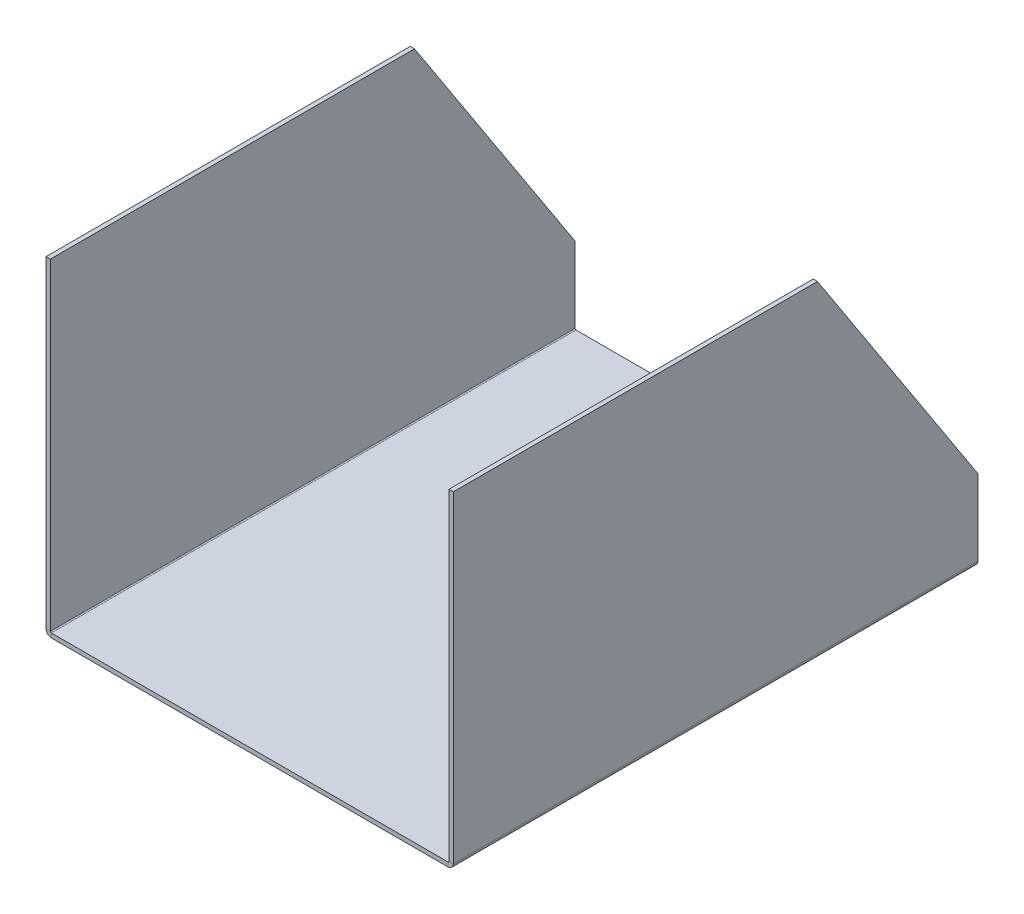
ISO-10303-21;
HEADER;
FILE_DESCRIPTION(('STEP AP214'),'2;1');
FILE_NAME('part.step','',(''),(''),'','','');
FILE_SCHEMA(('AUTOMOTIVE_DESIGN { 1 0 10303 214 1 1 1 1 }'));
ENDSEC;
DATA;
#1=APPLICATION_CONTEXT('core data for automotive mechanical design processes');
#2=APPLICATION_PROTOCOL_DEFINITION('international standard','automotive_design',2000,#1);
#3=PRODUCT_CONTEXT('',#1,'mechanical');
#4=PRODUCT('Part','Part','',(#3));
#5=PRODUCT_RELATED_PRODUCT_CATEGORY('part','',(#4));
#6=PRODUCT_DEFINITION_FORMATION('','',#4);
#7=PRODUCT_DEFINITION_CONTEXT('part definition',#1,'design');
#8=PRODUCT_DEFINITION('design','',#6,#7);
#9=PRODUCT_DEFINITION_SHAPE('','',#8);
#10=(LENGTH_UNIT() NAMED_UNIT(*) SI_UNIT(.MILLI.,.METRE.));
#11=(NAMED_UNIT(*) PLANE_ANGLE_UNIT() SI_UNIT($,.RADIAN.));
#12=(NAMED_UNIT(*) SI_UNIT($,.STERADIAN.) SOLID_ANGLE_UNIT());
#13=UNCERTAINTY_MEASURE_WITH_UNIT(LENGTH_MEASURE(1.E-05),#10,'distance_accuracy_value','');
#14=(GEOMETRIC_REPRESENTATION_CONTEXT(3) GLOBAL_UNCERTAINTY_ASSIGNED_CONTEXT((#13)) GLOBAL_UNIT_ASSIGNED_CONTEXT((#10,
#11,#12)) REPRESENTATION_CONTEXT('',''));
#15=CARTESIAN_POINT('',(0.,0.,0.));
#16=DIRECTION('',(0.,0.,1.));
#17=DIRECTION('',(1.,0.,0.));
#18=AXIS2_PLACEMENT_3D('',#15,#16,#17);
#19=CARTESIAN_POINT('',(-184.,-4.,0.));
#20=DIRECTION('',(0.,0.,-1.));
#21=DIRECTION('',(-1.,0.,0.));
#22=AXIS2_PLACEMENT_3D('',#19,#20,#21);
#23=PLANE('',#22);
#24=DIRECTION('',(0.,1.,0.));
#25=VECTOR('',#24,1.);
#26=CARTESIAN_POINT('',(-189.,0.,0.));
#27=LINE('',#26,#25);
#28=CARTESIAN_POINT('',(-189.,70.9999999999999,0.));
#29=VERTEX_POINT('',#28);
#30=CARTESIAN_POINT('',(-189.,1.,0.));
#31=VERTEX_POINT('',#30);
#32=EDGE_CURVE('E151',#29,#31,#27,.F.);
#33=ORIENTED_EDGE('',*,*,#32,.F.);
#34=DIRECTION('',(-1.,0.,0.));
#35=VECTOR('',#34,1.);
#36=CARTESIAN_POINT('',(-189.,70.9999999999998,0.));
#37=LINE('',#36,#35);
#38=CARTESIAN_POINT('',(-185.,70.9999999999998,0.));
#39=VERTEX_POINT('',#38);
#40=EDGE_CURVE('E54',#29,#39,#37,.F.);
#41=ORIENTED_EDGE('',*,*,#40,.T.);
#42=DIRECTION('',(0.,-1.,0.));
#43=VECTOR('',#42,1.);
#44=CARTESIAN_POINT('',(-185.,0.,0.));
#45=LINE('',#44,#43);
#46=CARTESIAN_POINT('',(-185.,1.,0.));
#47=VERTEX_POINT('',#46);
#48=EDGE_CURVE('E149',#39,#47,#45,.T.);
#49=ORIENTED_EDGE('',*,*,#48,.T.);
#50=DIRECTION('',(-1.,0.,0.));
#51=VECTOR('',#50,1.);
#52=CARTESIAN_POINT('',(-185.,1.,0.));
#53=LINE('',#52,#51);
#54=EDGE_CURVE('E221',#47,#31,#53,.T.);
#55=ORIENTED_EDGE('',*,*,#54,.T.);
#56=EDGE_LOOP('',(#33,#41,#49,#55));
#57=FACE_BOUND('',#56,.T.);
#58=ADVANCED_FACE('F39',(#57),#23,.T.);
#59=CARTESIAN_POINT('',(-185.,0.,487.));
#60=DIRECTION('',(1.,0.,0.));
#61=DIRECTION('',(0.,0.,-1.));
#62=AXIS2_PLACEMENT_3D('',#59,#60,#61);
#63=PLANE('',#62);
#64=ORIENTED_EDGE('',*,*,#48,.F.);
#65=DIRECTION('',(0.,0.838192650545649,0.545374257341929));
#66=VECTOR('',#65,1.);
#67=CARTESIAN_POINT('',(-185.,300.,149.));
#68=LINE('',#67,#66);
#69=CARTESIAN_POINT('',(-185.,300.,149.));
#70=VERTEX_POINT('',#69);
#71=EDGE_CURVE('E137',#39,#70,#68,.T.);
#72=ORIENTED_EDGE('',*,*,#71,.T.);
#73=DIRECTION('',(0.,0.,-1.));
#74=VECTOR('',#73,1.);
#75=CARTESIAN_POINT('',(-185.,300.,487.));
#76=LINE('',#75,#74);
#77=CARTESIAN_POINT('',(-185.,300.,487.));
#78=VERTEX_POINT('',#77);
#79=EDGE_CURVE('E193',#78,#70,#76,.T.);
#80=ORIENTED_EDGE('',*,*,#79,.F.);
#81=DIRECTION('',(0.,-1.,0.));
#82=VECTOR('',#81,1.);
#83=CARTESIAN_POINT('',(-185.,0.,487.));
#84=LINE('',#83,#82);
#85=CARTESIAN_POINT('',(-185.,1.,487.));
#86=VERTEX_POINT('',#85);
#87=EDGE_CURVE('E227',#78,#86,#84,.T.);
#88=ORIENTED_EDGE('',*,*,#87,.T.);
#89=DIRECTION('',(0.,0.,-1.));
#90=VECTOR('',#89,1.);
#91=CARTESIAN_POINT('',(-185.,1.,487.));
#92=LINE('',#91,#90);
#93=EDGE_CURVE('E157',#86,#47,#92,.T.);
#94=ORIENTED_EDGE('',*,*,#93,.T.);
#95=EDGE_LOOP('',(#64,#72,#80,#88,#94));
#96=FACE_BOUND('',#95,.T.);
#97=ADVANCED_FACE('F154',(#96),#63,.T.);
#98=CARTESIAN_POINT('',(-189.,300.,487.));
#99=DIRECTION('',(0.,1.,0.));
#100=DIRECTION('',(0.,0.,1.));
#101=AXIS2_PLACEMENT_3D('',#98,#99,#100);
#102=PLANE('',#101);
#103=ORIENTED_EDGE('',*,*,#79,.T.);
#104=DIRECTION('',(-1.,0.,0.));
#105=VECTOR('',#104,1.);
#106=CARTESIAN_POINT('',(-189.,300.,149.));
#107=LINE('',#106,#105);
#108=CARTESIAN_POINT('',(-189.,300.,149.));
#109=VERTEX_POINT('',#108);
#110=EDGE_CURVE('E140',#109,#70,#107,.F.);
#111=ORIENTED_EDGE('',*,*,#110,.F.);
#112=DIRECTION('',(0.,0.,-1.));
#113=VECTOR('',#112,1.);
#114=CARTESIAN_POINT('',(-189.,300.,487.));
#115=LINE('',#114,#113);
#116=CARTESIAN_POINT('',(-189.,300.,487.));
#117=VERTEX_POINT('',#116);
#118=EDGE_CURVE('E190',#117,#109,#115,.T.);
#119=ORIENTED_EDGE('',*,*,#118,.F.);
#120=DIRECTION('',(1.,0.,0.));
#121=VECTOR('',#120,1.);
#122=CARTESIAN_POINT('',(-189.,300.,487.));
#123=LINE('',#122,#121);
#124=EDGE_CURVE('E242',#117,#78,#123,.T.);
#125=ORIENTED_EDGE('',*,*,#124,.T.);
#126=EDGE_LOOP('',(#103,#111,#119,#125));
#127=FACE_BOUND('',#126,.T.);
#128=ADVANCED_FACE('F344',(#127),#102,.T.);
#129=CARTESIAN_POINT('',(-189.,0.,487.));
#130=DIRECTION('',(1.,0.,0.));
#131=DIRECTION('',(0.,0.,-1.));
#132=AXIS2_PLACEMENT_3D('',#129,#130,#131);
#133=PLANE('',#132);
#134=DIRECTION('',(0.,0.838192650545649,0.545374257341929));
#135=VECTOR('',#134,1.);
#136=CARTESIAN_POINT('',(-189.,300.,149.));
#137=LINE('',#136,#135);
#138=EDGE_CURVE('E144',#29,#109,#137,.T.);
#139=ORIENTED_EDGE('',*,*,#138,.F.);
#140=ORIENTED_EDGE('',*,*,#32,.T.);
#141=DIRECTION('',(0.,0.,-1.));
#142=VECTOR('',#141,1.);
#143=CARTESIAN_POINT('',(-189.,1.,487.));
#144=LINE('',#143,#142);
#145=CARTESIAN_POINT('',(-189.,1.,487.));
#146=VERTEX_POINT('',#145);
#147=EDGE_CURVE('E187',#146,#31,#144,.T.);
#148=ORIENTED_EDGE('',*,*,#147,.F.);
#149=DIRECTION('',(0.,1.,0.));
#150=VECTOR('',#149,1.);
#151=CARTESIAN_POINT('',(-189.,0.,487.));
#152=LINE('',#151,#150);
#153=EDGE_CURVE('E230',#117,#146,#152,.F.);
#154=ORIENTED_EDGE('',*,*,#153,.F.);
#155=ORIENTED_EDGE('',*,*,#118,.T.);
#156=EDGE_LOOP('',(#139,#140,#148,#154,#155));
#157=FACE_BOUND('',#156,.T.);
#158=ADVANCED_FACE('F283',(#157),#133,.F.);
#159=CARTESIAN_POINT('',(189.,0.,487.));
#160=DIRECTION('',(-1.,0.,0.));
#161=DIRECTION('',(0.,0.,1.));
#162=AXIS2_PLACEMENT_3D('',#159,#160,#161);
#163=PLANE('',#162);
#164=DIRECTION('',(0.,-0.838192650545649,-0.545374257341929));
#165=VECTOR('',#164,1.);
#166=CARTESIAN_POINT('',(189.,71.0000000000001,0.));
#167=LINE('',#166,#165);
#168=CARTESIAN_POINT('',(189.,300.,149.));
#169=VERTEX_POINT('',#168);
#170=CARTESIAN_POINT('',(189.,71.0000000000001,0.));
#171=VERTEX_POINT('',#170);
#172=EDGE_CURVE('E62',#169,#171,#167,.T.);
#173=ORIENTED_EDGE('',*,*,#172,.F.);
#174=DIRECTION('',(0.,0.,-1.));
#175=VECTOR('',#174,1.);
#176=CARTESIAN_POINT('',(189.,300.,487.));
#177=LINE('',#176,#175);
#178=CARTESIAN_POINT('',(189.,300.,487.));
#179=VERTEX_POINT('',#178);
#180=EDGE_CURVE('E208',#179,#169,#177,.T.);
#181=ORIENTED_EDGE('',*,*,#180,.F.);
#182=DIRECTION('',(0.,1.,0.));
#183=VECTOR('',#182,1.);
#184=CARTESIAN_POINT('',(189.,0.,487.));
#185=LINE('',#184,#183);
#186=CARTESIAN_POINT('',(189.,1.00000000000007,487.));
#187=VERTEX_POINT('',#186);
#188=EDGE_CURVE('E176',#187,#179,#185,.T.);
#189=ORIENTED_EDGE('',*,*,#188,.F.);
#190=DIRECTION('',(0.,0.,-1.));
#191=VECTOR('',#190,1.);
#192=CARTESIAN_POINT('',(189.,1.00000000000007,487.));
#193=LINE('',#192,#191);
#194=CARTESIAN_POINT('',(189.,1.00000000000007,0.));
#195=VERTEX_POINT('',#194);
#196=EDGE_CURVE('E177',#187,#195,#193,.T.);
#197=ORIENTED_EDGE('',*,*,#196,.T.);
#198=DIRECTION('',(0.,1.,0.));
#199=VECTOR('',#198,1.);
#200=CARTESIAN_POINT('',(189.,0.,0.));
#201=LINE('',#200,#199);
#202=EDGE_CURVE('E255',#195,#171,#201,.T.);
#203=ORIENTED_EDGE('',*,*,#202,.T.);
#204=EDGE_LOOP('',(#173,#181,#189,#197,#203));
#205=FACE_BOUND('',#204,.T.);
#206=ADVANCED_FACE('F336',(#205),#163,.F.);
#207=CARTESIAN_POINT('',(185.,300.,487.));
#208=DIRECTION('',(0.,1.,0.));
#209=DIRECTION('',(0.,0.,1.));
#210=AXIS2_PLACEMENT_3D('',#207,#208,#209);
#211=PLANE('',#210);
#212=ORIENTED_EDGE('',*,*,#180,.T.);
#213=DIRECTION('',(1.,0.,0.));
#214=VECTOR('',#213,1.);
#215=CARTESIAN_POINT('',(189.,300.,149.));
#216=LINE('',#215,#214);
#217=CARTESIAN_POINT('',(185.,300.,149.));
#218=VERTEX_POINT('',#217);
#219=EDGE_CURVE('E259',#169,#218,#216,.F.);
#220=ORIENTED_EDGE('',*,*,#219,.T.);
#221=DIRECTION('',(0.,0.,-1.));
#222=VECTOR('',#221,1.);
#223=CARTESIAN_POINT('',(185.,300.,487.));
#224=LINE('',#223,#222);
#225=CARTESIAN_POINT('',(185.,300.,487.));
#226=VERTEX_POINT('',#225);
#227=EDGE_CURVE('E205',#226,#218,#224,.T.);
#228=ORIENTED_EDGE('',*,*,#227,.F.);
#229=DIRECTION('',(1.,0.,0.));
#230=VECTOR('',#229,1.);
#231=CARTESIAN_POINT('',(185.,300.,487.));
#232=LINE('',#231,#230);
#233=EDGE_CURVE('E296',#226,#179,#232,.T.);
#234=ORIENTED_EDGE('',*,*,#233,.T.);
#235=EDGE_LOOP('',(#212,#220,#228,#234));
#236=FACE_BOUND('',#235,.T.);
#237=ADVANCED_FACE('F326',(#236),#211,.T.);
#238=CARTESIAN_POINT('',(185.,0.,487.));
#239=DIRECTION('',(-1.,0.,0.));
#240=DIRECTION('',(0.,0.,1.));
#241=AXIS2_PLACEMENT_3D('',#238,#239,#240);
#242=PLANE('',#241);
#243=ORIENTED_EDGE('',*,*,#227,.T.);
#244=DIRECTION('',(0.,-0.838192650545649,-0.545374257341929));
#245=VECTOR('',#244,1.);
#246=CARTESIAN_POINT('',(185.,71.0000000000001,0.));
#247=LINE('',#246,#245);
#248=CARTESIAN_POINT('',(185.,71.0000000000001,0.));
#249=VERTEX_POINT('',#248);
#250=EDGE_CURVE('E287',#218,#249,#247,.T.);
#251=ORIENTED_EDGE('',*,*,#250,.T.);
#252=DIRECTION('',(0.,1.,0.));
#253=VECTOR('',#252,1.);
#254=CARTESIAN_POINT('',(185.,0.,0.));
#255=LINE('',#254,#253);
#256=CARTESIAN_POINT('',(185.,1.00000000000007,0.));
#257=VERTEX_POINT('',#256);
#258=EDGE_CURVE('E258',#257,#249,#255,.T.);
#259=ORIENTED_EDGE('',*,*,#258,.F.);
#260=DIRECTION('',(0.,0.,-1.));
#261=VECTOR('',#260,1.);
#262=CARTESIAN_POINT('',(185.,1.00000000000007,487.));
#263=LINE('',#262,#261);
#264=CARTESIAN_POINT('',(185.,1.00000000000007,487.));
#265=VERTEX_POINT('',#264);
#266=EDGE_CURVE('E202',#265,#257,#263,.T.);
#267=ORIENTED_EDGE('',*,*,#266,.F.);
#268=DIRECTION('',(0.,1.,0.));
#269=VECTOR('',#268,1.);
#270=CARTESIAN_POINT('',(185.,0.,487.));
#271=LINE('',#270,#269);
#272=EDGE_CURVE('E299',#265,#226,#271,.T.);
#273=ORIENTED_EDGE('',*,*,#272,.T.);
#274=EDGE_LOOP('',(#243,#251,#259,#267,#273));
#275=FACE_BOUND('',#274,.T.);
#276=ADVANCED_FACE('F320',(#275),#242,.T.);
#277=CARTESIAN_POINT('',(184.,1.00000000000007,0.));
#278=DIRECTION('',(0.,0.,-1.));
#279=DIRECTION('',(-1.,0.,0.));
#280=AXIS2_PLACEMENT_3D('',#277,#278,#279);
#281=PLANE('',#280);
#282=ORIENTED_EDGE('',*,*,#258,.T.);
#283=DIRECTION('',(1.,0.,0.));
#284=VECTOR('',#283,1.);
#285=CARTESIAN_POINT('',(189.,71.0000000000001,0.));
#286=LINE('',#285,#284);
#287=EDGE_CURVE('E290',#171,#249,#286,.F.);
#288=ORIENTED_EDGE('',*,*,#287,.F.);
#289=ORIENTED_EDGE('',*,*,#202,.F.);
#290=DIRECTION('',(-1.,0.,0.));
#291=VECTOR('',#290,1.);
#292=CARTESIAN_POINT('',(189.,1.00000000000007,0.));
#293=LINE('',#292,#291);
#294=EDGE_CURVE('E211',#195,#257,#293,.T.);
#295=ORIENTED_EDGE('',*,*,#294,.T.);
#296=EDGE_LOOP('',(#282,#288,#289,#295));
#297=FACE_BOUND('',#296,.T.);
#298=ADVANCED_FACE('F328',(#297),#281,.T.);
#299=CARTESIAN_POINT('',(-184.,0.,487.));
#300=DIRECTION('',(0.,0.,1.));
#301=DIRECTION('',(1.,0.,0.));
#302=AXIS2_PLACEMENT_3D('',#299,#300,#301);
#303=PLANE('',#302);
#304=DIRECTION('',(0.,-1.,0.));
#305=VECTOR('',#304,1.);
#306=CARTESIAN_POINT('',(-184.,0.,487.));
#307=LINE('',#306,#305);
#308=CARTESIAN_POINT('',(-184.,0.,487.));
#309=VERTEX_POINT('',#308);
#310=CARTESIAN_POINT('',(-184.,-4.,487.));
#311=VERTEX_POINT('',#310);
#312=EDGE_CURVE('E11',#309,#311,#307,.T.);
#313=ORIENTED_EDGE('',*,*,#312,.F.);
#314=CARTESIAN_POINT('',(-184.,1.,487.));
#315=DIRECTION('',(0.,0.,-1.));
#316=DIRECTION('',(-1.,0.,0.));
#317=AXIS2_PLACEMENT_3D('',#314,#315,#316);
#318=CIRCLE('',#317,1.);
#319=EDGE_CURVE('E238',#86,#309,#318,.F.);
#320=ORIENTED_EDGE('',*,*,#319,.F.);
#321=DIRECTION('',(1.,0.,0.));
#322=VECTOR('',#321,1.);
#323=CARTESIAN_POINT('',(-189.,1.,487.));
#324=LINE('',#323,#322);
#325=EDGE_CURVE('E47',#146,#86,#324,.T.);
#326=ORIENTED_EDGE('',*,*,#325,.F.);
#327=CARTESIAN_POINT('',(-184.,1.,487.));
#328=DIRECTION('',(0.,0.,1.));
#329=DIRECTION('',(1.,0.,0.));
#330=AXIS2_PLACEMENT_3D('',#327,#328,#329);
#331=CIRCLE('',#330,5.);
#332=EDGE_CURVE('E248',#146,#311,#331,.T.);
#333=ORIENTED_EDGE('',*,*,#332,.T.);
#334=EDGE_LOOP('',(#313,#320,#326,#333));
#335=FACE_BOUND('',#334,.T.);
#336=ADVANCED_FACE('F41',(#335),#303,.T.);
#337=CARTESIAN_POINT('',(-189.,1.,487.));
#338=DIRECTION('',(0.,0.,1.));
#339=DIRECTION('',(1.,0.,0.));
#340=AXIS2_PLACEMENT_3D('',#337,#338,#339);
#341=PLANE('',#340);
#342=DIRECTION('',(1.,0.,0.));
#343=VECTOR('',#342,1.);
#344=CARTESIAN_POINT('',(-185.,0.,487.));
#345=LINE('',#344,#343);
#346=CARTESIAN_POINT('',(184.,0.,487.));
#347=VERTEX_POINT('',#346);
#348=EDGE_CURVE('E240',#309,#347,#345,.T.);
#349=ORIENTED_EDGE('',*,*,#348,.F.);
#350=ORIENTED_EDGE('',*,*,#312,.T.);
#351=DIRECTION('',(1.,0.,0.));
#352=VECTOR('',#351,1.);
#353=CARTESIAN_POINT('',(-185.,-4.,487.));
#354=LINE('',#353,#352);
#355=CARTESIAN_POINT('',(184.,-3.99999999999993,487.));
#356=VERTEX_POINT('',#355);
#357=EDGE_CURVE('E250',#311,#356,#354,.T.);
#358=ORIENTED_EDGE('',*,*,#357,.T.);
#359=DIRECTION('',(0.,1.,0.));
#360=VECTOR('',#359,1.);
#361=CARTESIAN_POINT('',(184.,-3.99999999999993,487.));
#362=LINE('',#361,#360);
#363=EDGE_CURVE('E215',#356,#347,#362,.T.);
#364=ORIENTED_EDGE('',*,*,#363,.T.);
#365=EDGE_LOOP('',(#349,#350,#358,#364));
#366=FACE_BOUND('',#365,.T.);
#367=ADVANCED_FACE('F305',(#366),#341,.T.);
#368=CARTESIAN_POINT('',(-185.,1.,0.));
#369=DIRECTION('',(0.,0.,-1.));
#370=DIRECTION('',(-1.,0.,0.));
#371=AXIS2_PLACEMENT_3D('',#368,#369,#370);
#372=PLANE('',#371);
#373=ORIENTED_EDGE('',*,*,#54,.F.);
#374=CARTESIAN_POINT('',(-184.,1.,0.));
#375=DIRECTION('',(0.,0.,-1.));
#376=DIRECTION('',(-1.,0.,0.));
#377=AXIS2_PLACEMENT_3D('',#374,#375,#376);
#378=CIRCLE('',#377,1.);
#379=CARTESIAN_POINT('',(-184.,0.,0.));
#380=VERTEX_POINT('',#379);
#381=EDGE_CURVE('E159',#47,#380,#378,.F.);
#382=ORIENTED_EDGE('',*,*,#381,.T.);
#383=DIRECTION('',(0.,1.,0.));
#384=VECTOR('',#383,1.);
#385=CARTESIAN_POINT('',(-184.,-4.,0.));
#386=LINE('',#385,#384);
#387=CARTESIAN_POINT('',(-184.,-4.,0.));
#388=VERTEX_POINT('',#387);
#389=EDGE_CURVE('E219',#388,#380,#386,.T.);
#390=ORIENTED_EDGE('',*,*,#389,.F.);
#391=CARTESIAN_POINT('',(-184.,1.,0.));
#392=DIRECTION('',(0.,0.,1.));
#393=DIRECTION('',(1.,0.,0.));
#394=AXIS2_PLACEMENT_3D('',#391,#392,#393);
#395=CIRCLE('',#394,5.);
#396=EDGE_CURVE('E161',#31,#388,#395,.T.);
#397=ORIENTED_EDGE('',*,*,#396,.F.);
#398=EDGE_LOOP('',(#373,#382,#390,#397));
#399=FACE_BOUND('',#398,.T.);
#400=ADVANCED_FACE('F276',(#399),#372,.T.);
#401=CARTESIAN_POINT('',(185.,1.00000000000007,487.));
#402=DIRECTION('',(0.,0.,1.));
#403=DIRECTION('',(1.,0.,0.));
#404=AXIS2_PLACEMENT_3D('',#401,#402,#403);
#405=PLANE('',#404);
#406=DIRECTION('',(1.,0.,0.));
#407=VECTOR('',#406,1.);
#408=CARTESIAN_POINT('',(185.,1.00000000000007,487.));
#409=LINE('',#408,#407);
#410=EDGE_CURVE('E217',#265,#187,#409,.T.);
#411=ORIENTED_EDGE('',*,*,#410,.F.);
#412=CARTESIAN_POINT('',(184.,1.00000000000007,487.));
#413=DIRECTION('',(0.,0.,-1.));
#414=DIRECTION('',(-1.,0.,0.));
#415=AXIS2_PLACEMENT_3D('',#412,#413,#414);
#416=CIRCLE('',#415,1.);
#417=EDGE_CURVE('E302',#347,#265,#416,.F.);
#418=ORIENTED_EDGE('',*,*,#417,.F.);
#419=ORIENTED_EDGE('',*,*,#363,.F.);
#420=CARTESIAN_POINT('',(184.,1.00000000000007,487.));
#421=DIRECTION('',(0.,0.,1.));
#422=DIRECTION('',(1.,0.,0.));
#423=AXIS2_PLACEMENT_3D('',#420,#421,#422);
#424=CIRCLE('',#423,5.);
#425=EDGE_CURVE('E181',#356,#187,#424,.T.);
#426=ORIENTED_EDGE('',*,*,#425,.T.);
#427=EDGE_LOOP('',(#411,#418,#419,#426));
#428=FACE_BOUND('',#427,.T.);
#429=ADVANCED_FACE('F312',(#428),#405,.T.);
#430=CARTESIAN_POINT('',(184.,-3.99999999999993,487.));
#431=DIRECTION('',(0.,0.,1.));
#432=DIRECTION('',(1.,0.,0.));
#433=AXIS2_PLACEMENT_3D('',#430,#431,#432);
#434=PLANE('',#433);
#435=ORIENTED_EDGE('',*,*,#272,.F.);
#436=ORIENTED_EDGE('',*,*,#410,.T.);
#437=ORIENTED_EDGE('',*,*,#188,.T.);
#438=ORIENTED_EDGE('',*,*,#233,.F.);
#439=EDGE_LOOP('',(#435,#436,#437,#438));
#440=FACE_BOUND('',#439,.T.);
#441=ADVANCED_FACE('F322',(#440),#434,.T.);
#442=CARTESIAN_POINT('',(184.,0.,0.));
#443=DIRECTION('',(0.,0.,-1.));
#444=DIRECTION('',(-1.,0.,0.));
#445=AXIS2_PLACEMENT_3D('',#442,#443,#444);
#446=PLANE('',#445);
#447=DIRECTION('',(0.,-1.,0.));
#448=VECTOR('',#447,1.);
#449=CARTESIAN_POINT('',(184.,0.,0.));
#450=LINE('',#449,#448);
#451=CARTESIAN_POINT('',(184.,0.,0.));
#452=VERTEX_POINT('',#451);
#453=CARTESIAN_POINT('',(184.,-3.99999999999993,0.));
#454=VERTEX_POINT('',#453);
#455=EDGE_CURVE('E213',#452,#454,#450,.T.);
#456=ORIENTED_EDGE('',*,*,#455,.F.);
#457=CARTESIAN_POINT('',(184.,1.00000000000007,0.));
#458=DIRECTION('',(0.,0.,-1.));
#459=DIRECTION('',(-1.,0.,0.));
#460=AXIS2_PLACEMENT_3D('',#457,#458,#459);
#461=CIRCLE('',#460,1.);
#462=EDGE_CURVE('E262',#452,#257,#461,.F.);
#463=ORIENTED_EDGE('',*,*,#462,.T.);
#464=ORIENTED_EDGE('',*,*,#294,.F.);
#465=CARTESIAN_POINT('',(184.,1.00000000000007,0.));
#466=DIRECTION('',(0.,0.,1.));
#467=DIRECTION('',(1.,0.,0.));
#468=AXIS2_PLACEMENT_3D('',#465,#466,#467);
#469=CIRCLE('',#468,5.);
#470=EDGE_CURVE('E173',#454,#195,#469,.T.);
#471=ORIENTED_EDGE('',*,*,#470,.F.);
#472=EDGE_LOOP('',(#456,#463,#464,#471));
#473=FACE_BOUND('',#472,.T.);
#474=ADVANCED_FACE('F332',(#473),#446,.T.);
#475=CARTESIAN_POINT('',(189.,1.00000000000007,0.));
#476=DIRECTION('',(0.,0.,-1.));
#477=DIRECTION('',(-1.,0.,0.));
#478=AXIS2_PLACEMENT_3D('',#475,#476,#477);
#479=PLANE('',#478);
#480=DIRECTION('',(1.,0.,0.));
#481=VECTOR('',#480,1.);
#482=CARTESIAN_POINT('',(-185.,0.,0.));
#483=LINE('',#482,#481);
#484=EDGE_CURVE('E164',#380,#452,#483,.T.);
#485=ORIENTED_EDGE('',*,*,#484,.T.);
#486=ORIENTED_EDGE('',*,*,#455,.T.);
#487=DIRECTION('',(1.,0.,0.));
#488=VECTOR('',#487,1.);
#489=CARTESIAN_POINT('',(-185.,-4.,0.));
#490=LINE('',#489,#488);
#491=EDGE_CURVE('E170',#388,#454,#490,.T.);
#492=ORIENTED_EDGE('',*,*,#491,.F.);
#493=ORIENTED_EDGE('',*,*,#389,.T.);
#494=EDGE_LOOP('',(#485,#486,#492,#493));
#495=FACE_BOUND('',#494,.T.);
#496=ADVANCED_FACE('F267',(#495),#479,.T.);
#497=CARTESIAN_POINT('',(184.,1.00000000000007,487.));
#498=DIRECTION('',(0.,0.,-1.));
#499=DIRECTION('',(-1.,0.,0.));
#500=AXIS2_PLACEMENT_3D('',#497,#498,#499);
#501=CYLINDRICAL_SURFACE('',#500,1.);
#502=ORIENTED_EDGE('',*,*,#462,.F.);
#503=DIRECTION('',(0.,0.,-1.));
#504=VECTOR('',#503,1.);
#505=CARTESIAN_POINT('',(184.,0.,487.));
#506=LINE('',#505,#504);
#507=EDGE_CURVE('E199',#347,#452,#506,.T.);
#508=ORIENTED_EDGE('',*,*,#507,.F.);
#509=ORIENTED_EDGE('',*,*,#417,.T.);
#510=ORIENTED_EDGE('',*,*,#266,.T.);
#511=EDGE_LOOP('',(#502,#508,#509,#510));
#512=FACE_BOUND('',#511,.T.);
#513=ADVANCED_FACE('F311',(#512),#501,.F.);
#514=CARTESIAN_POINT('',(-185.,0.,487.));
#515=DIRECTION('',(0.,1.,0.));
#516=DIRECTION('',(-1.,0.,0.));
#517=AXIS2_PLACEMENT_3D('',#514,#515,#516);
#518=PLANE('',#517);
#519=ORIENTED_EDGE('',*,*,#484,.F.);
#520=DIRECTION('',(0.,0.,-1.));
#521=VECTOR('',#520,1.);
#522=CARTESIAN_POINT('',(-184.,0.,487.));
#523=LINE('',#522,#521);
#524=EDGE_CURVE('E196',#309,#380,#523,.T.);
#525=ORIENTED_EDGE('',*,*,#524,.F.);
#526=ORIENTED_EDGE('',*,*,#348,.T.);
#527=ORIENTED_EDGE('',*,*,#507,.T.);
#528=EDGE_LOOP('',(#519,#525,#526,#527));
#529=FACE_BOUND('',#528,.T.);
#530=ADVANCED_FACE('F270',(#529),#518,.T.);
#531=CARTESIAN_POINT('',(-184.,1.,487.));
#532=DIRECTION('',(0.,0.,-1.));
#533=DIRECTION('',(-1.,0.,0.));
#534=AXIS2_PLACEMENT_3D('',#531,#532,#533);
#535=CYLINDRICAL_SURFACE('',#534,1.);
#536=ORIENTED_EDGE('',*,*,#381,.F.);
#537=ORIENTED_EDGE('',*,*,#93,.F.);
#538=ORIENTED_EDGE('',*,*,#319,.T.);
#539=ORIENTED_EDGE('',*,*,#524,.T.);
#540=EDGE_LOOP('',(#536,#537,#538,#539));
#541=FACE_BOUND('',#540,.T.);
#542=ADVANCED_FACE('F237',(#541),#535,.F.);
#543=CARTESIAN_POINT('',(-184.,1.,487.));
#544=DIRECTION('',(0.,0.,-1.));
#545=DIRECTION('',(-1.,0.,0.));
#546=AXIS2_PLACEMENT_3D('',#543,#544,#545);
#547=CYLINDRICAL_SURFACE('',#546,5.);
#548=ORIENTED_EDGE('',*,*,#396,.T.);
#549=DIRECTION('',(0.,0.,-1.));
#550=VECTOR('',#549,1.);
#551=CARTESIAN_POINT('',(-184.,-4.,487.));
#552=LINE('',#551,#550);
#553=EDGE_CURVE('E184',#311,#388,#552,.T.);
#554=ORIENTED_EDGE('',*,*,#553,.F.);
#555=ORIENTED_EDGE('',*,*,#332,.F.);
#556=ORIENTED_EDGE('',*,*,#147,.T.);
#557=EDGE_LOOP('',(#548,#554,#555,#556));
#558=FACE_BOUND('',#557,.T.);
#559=ADVANCED_FACE('F280',(#558),#547,.T.);
#560=CARTESIAN_POINT('',(-185.,-4.,487.));
#561=DIRECTION('',(0.,1.,0.));
#562=DIRECTION('',(-1.,0.,0.));
#563=AXIS2_PLACEMENT_3D('',#560,#561,#562);
#564=PLANE('',#563);
#565=ORIENTED_EDGE('',*,*,#491,.T.);
#566=DIRECTION('',(0.,0.,-1.));
#567=VECTOR('',#566,1.);
#568=CARTESIAN_POINT('',(184.,-3.99999999999993,487.));
#569=LINE('',#568,#567);
#570=EDGE_CURVE('E180',#356,#454,#569,.T.);
#571=ORIENTED_EDGE('',*,*,#570,.F.);
#572=ORIENTED_EDGE('',*,*,#357,.F.);
#573=ORIENTED_EDGE('',*,*,#553,.T.);
#574=EDGE_LOOP('',(#565,#571,#572,#573));
#575=FACE_BOUND('',#574,.T.);
#576=ADVANCED_FACE('F374',(#575),#564,.F.);
#577=CARTESIAN_POINT('',(184.,1.00000000000007,487.));
#578=DIRECTION('',(0.,0.,-1.));
#579=DIRECTION('',(-1.,0.,0.));
#580=AXIS2_PLACEMENT_3D('',#577,#578,#579);
#581=CYLINDRICAL_SURFACE('',#580,5.);
#582=ORIENTED_EDGE('',*,*,#470,.T.);
#583=ORIENTED_EDGE('',*,*,#196,.F.);
#584=ORIENTED_EDGE('',*,*,#425,.F.);
#585=ORIENTED_EDGE('',*,*,#570,.T.);
#586=EDGE_LOOP('',(#582,#583,#584,#585));
#587=FACE_BOUND('',#586,.T.);
#588=ADVANCED_FACE('F334',(#587),#581,.T.);
#589=CARTESIAN_POINT('',(184.,1.00000000000007,487.));
#590=DIRECTION('',(0.,0.,-1.));
#591=DIRECTION('',(-1.,0.,0.));
#592=AXIS2_PLACEMENT_3D('',#589,#590,#591);
#593=PLANE('',#592);
#594=ORIENTED_EDGE('',*,*,#153,.T.);
#595=ORIENTED_EDGE('',*,*,#325,.T.);
#596=ORIENTED_EDGE('',*,*,#87,.F.);
#597=ORIENTED_EDGE('',*,*,#124,.F.);
#598=EDGE_LOOP('',(#594,#595,#596,#597));
#599=FACE_BOUND('',#598,.T.);
#600=ADVANCED_FACE('F225',(#599),#593,.F.);
#601=CARTESIAN_POINT('',(189.,71.0000000000001,0.));
#602=DIRECTION('',(0.,0.545374257341929,-0.838192650545649));
#603=DIRECTION('',(0.,-0.838192650545649,-0.545374257341929));
#604=AXIS2_PLACEMENT_3D('',#601,#602,#603);
#605=PLANE('',#604);
#606=ORIENTED_EDGE('',*,*,#219,.F.);
#607=ORIENTED_EDGE('',*,*,#172,.T.);
#608=ORIENTED_EDGE('',*,*,#287,.T.);
#609=ORIENTED_EDGE('',*,*,#250,.F.);
#610=EDGE_LOOP('',(#606,#607,#608,#609));
#611=FACE_BOUND('',#610,.T.);
#612=ADVANCED_FACE('F454',(#611),#605,.T.);
#613=CARTESIAN_POINT('',(-189.,300.,149.));
#614=DIRECTION('',(0.,0.545374257341929,-0.838192650545649));
#615=DIRECTION('',(0.,0.838192650545649,0.545374257341929));
#616=AXIS2_PLACEMENT_3D('',#613,#614,#615);
#617=PLANE('',#616);
#618=ORIENTED_EDGE('',*,*,#40,.F.);
#619=ORIENTED_EDGE('',*,*,#138,.T.);
#620=ORIENTED_EDGE('',*,*,#110,.T.);
#621=ORIENTED_EDGE('',*,*,#71,.F.);
#622=EDGE_LOOP('',(#618,#619,#620,#621));
#623=FACE_BOUND('',#622,.T.);
#624=ADVANCED_FACE('F138',(#623),#617,.T.);
#625=CLOSED_SHELL('',(#58,#97,#128,#158,#206,#237,#276,#298,#336,#367,#400,#429,#441,#474,#496,
#513,#530,#542,#559,#576,#588,#600,#612,#624));
#626=MANIFOLD_SOLID_BREP('B2',#625);
#627=ADVANCED_BREP_SHAPE_REPRESENTATION('',(#18,#626),#14);
#628=SHAPE_DEFINITION_REPRESENTATION(#9,#627);
ENDSEC;
END-ISO-10303-21;
